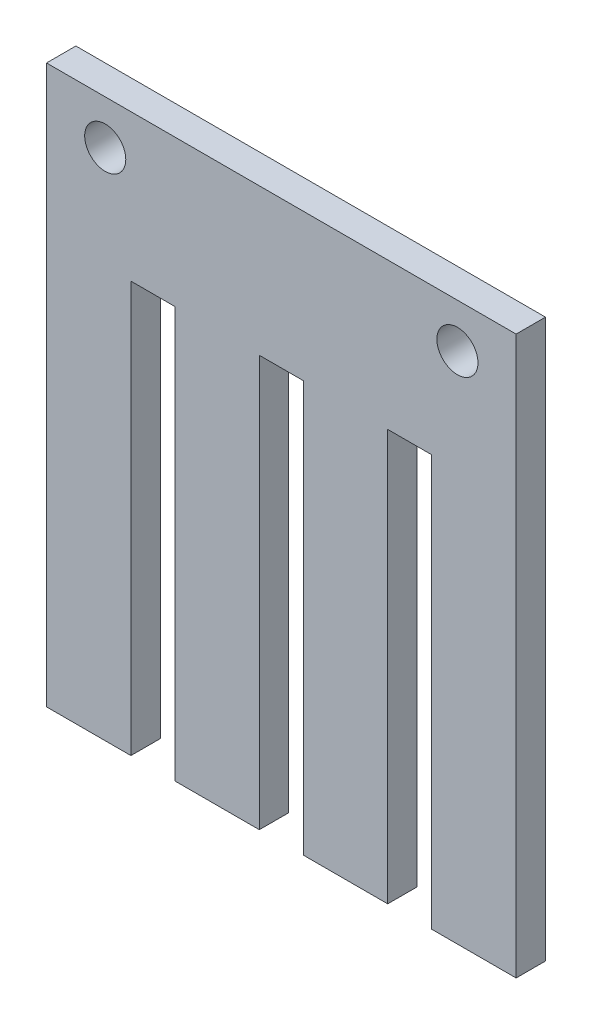
ISO-10303-21;
HEADER;
FILE_DESCRIPTION(('STEP AP214'),'2;1');
FILE_NAME('part.step','',(''),(''),'','','');
FILE_SCHEMA(('AUTOMOTIVE_DESIGN { 1 0 10303 214 1 1 1 1 }'));
ENDSEC;
DATA;
#1=APPLICATION_CONTEXT('core data for automotive mechanical design processes');
#2=APPLICATION_PROTOCOL_DEFINITION('international standard','automotive_design',2000,#1);
#3=PRODUCT_CONTEXT('',#1,'mechanical');
#4=PRODUCT('Part','Part','',(#3));
#5=PRODUCT_RELATED_PRODUCT_CATEGORY('part','',(#4));
#6=PRODUCT_DEFINITION_FORMATION('','',#4);
#7=PRODUCT_DEFINITION_CONTEXT('part definition',#1,'design');
#8=PRODUCT_DEFINITION('design','',#6,#7);
#9=PRODUCT_DEFINITION_SHAPE('','',#8);
#10=(LENGTH_UNIT() NAMED_UNIT(*) SI_UNIT(.MILLI.,.METRE.));
#11=(NAMED_UNIT(*) PLANE_ANGLE_UNIT() SI_UNIT($,.RADIAN.));
#12=(NAMED_UNIT(*) SI_UNIT($,.STERADIAN.) SOLID_ANGLE_UNIT());
#13=UNCERTAINTY_MEASURE_WITH_UNIT(LENGTH_MEASURE(1.E-05),#10,'distance_accuracy_value','');
#14=(GEOMETRIC_REPRESENTATION_CONTEXT(3) GLOBAL_UNCERTAINTY_ASSIGNED_CONTEXT((#13)) GLOBAL_UNIT_ASSIGNED_CONTEXT((#10,
#11,#12)) REPRESENTATION_CONTEXT('',''));
#15=CARTESIAN_POINT('',(0.,0.,0.));
#16=DIRECTION('',(0.,0.,1.));
#17=DIRECTION('',(1.,0.,0.));
#18=AXIS2_PLACEMENT_3D('',#15,#16,#17);
#19=CARTESIAN_POINT('',(-40.,0.,-5.));
#20=DIRECTION('',(-1.,0.,0.));
#21=DIRECTION('',(0.,-1.,0.));
#22=AXIS2_PLACEMENT_3D('',#19,#20,#21);
#23=PLANE('',#22);
#24=DIRECTION('',(0.,-1.,0.));
#25=VECTOR('',#24,1.);
#26=CARTESIAN_POINT('',(-40.,0.,0.));
#27=LINE('',#26,#25);
#28=CARTESIAN_POINT('',(-40.,0.,0.));
#29=VERTEX_POINT('',#28);
#30=CARTESIAN_POINT('',(-40.,-95.,0.));
#31=VERTEX_POINT('',#30);
#32=EDGE_CURVE('E181',#29,#31,#27,.T.);
#33=ORIENTED_EDGE('',*,*,#32,.F.);
#34=DIRECTION('',(0.,0.,1.));
#35=VECTOR('',#34,1.);
#36=CARTESIAN_POINT('',(-40.,0.,-5.));
#37=LINE('',#36,#35);
#38=CARTESIAN_POINT('',(-40.,0.,-5.));
#39=VERTEX_POINT('',#38);
#40=EDGE_CURVE('E11',#39,#29,#37,.T.);
#41=ORIENTED_EDGE('',*,*,#40,.F.);
#42=DIRECTION('',(0.,-1.,0.));
#43=VECTOR('',#42,1.);
#44=CARTESIAN_POINT('',(-40.,0.,-5.));
#45=LINE('',#44,#43);
#46=CARTESIAN_POINT('',(-40.,-95.,-5.));
#47=VERTEX_POINT('',#46);
#48=EDGE_CURVE('E226',#39,#47,#45,.T.);
#49=ORIENTED_EDGE('',*,*,#48,.T.);
#50=DIRECTION('',(0.,0.,1.));
#51=VECTOR('',#50,1.);
#52=CARTESIAN_POINT('',(-40.,-95.,-5.));
#53=LINE('',#52,#51);
#54=EDGE_CURVE('E39',#47,#31,#53,.T.);
#55=ORIENTED_EDGE('',*,*,#54,.T.);
#56=EDGE_LOOP('',(#33,#41,#49,#55));
#57=FACE_BOUND('',#56,.T.);
#58=ADVANCED_FACE('F36',(#57),#23,.T.);
#59=CARTESIAN_POINT('',(40.,0.,-5.));
#60=DIRECTION('',(0.,1.,0.));
#61=DIRECTION('',(-1.,0.,0.));
#62=AXIS2_PLACEMENT_3D('',#59,#60,#61);
#63=PLANE('',#62);
#64=DIRECTION('',(-1.,0.,0.));
#65=VECTOR('',#64,1.);
#66=CARTESIAN_POINT('',(40.,0.,0.));
#67=LINE('',#66,#65);
#68=CARTESIAN_POINT('',(40.,0.,0.));
#69=VERTEX_POINT('',#68);
#70=EDGE_CURVE('E224',#69,#29,#67,.T.);
#71=ORIENTED_EDGE('',*,*,#70,.F.);
#72=DIRECTION('',(0.,0.,1.));
#73=VECTOR('',#72,1.);
#74=CARTESIAN_POINT('',(40.,0.,-5.));
#75=LINE('',#74,#73);
#76=CARTESIAN_POINT('',(40.,0.,-5.));
#77=VERTEX_POINT('',#76);
#78=EDGE_CURVE('E45',#77,#69,#75,.T.);
#79=ORIENTED_EDGE('',*,*,#78,.F.);
#80=DIRECTION('',(-1.,0.,0.));
#81=VECTOR('',#80,1.);
#82=CARTESIAN_POINT('',(40.,0.,-5.));
#83=LINE('',#82,#81);
#84=EDGE_CURVE('E171',#77,#39,#83,.T.);
#85=ORIENTED_EDGE('',*,*,#84,.T.);
#86=ORIENTED_EDGE('',*,*,#40,.T.);
#87=EDGE_LOOP('',(#71,#79,#85,#86));
#88=FACE_BOUND('',#87,.T.);
#89=ADVANCED_FACE('F254',(#88),#63,.T.);
#90=CARTESIAN_POINT('',(40.,-95.,-5.));
#91=DIRECTION('',(1.,0.,0.));
#92=DIRECTION('',(0.,1.,0.));
#93=AXIS2_PLACEMENT_3D('',#90,#91,#92);
#94=PLANE('',#93);
#95=DIRECTION('',(0.,1.,0.));
#96=VECTOR('',#95,1.);
#97=CARTESIAN_POINT('',(40.,-95.,0.));
#98=LINE('',#97,#96);
#99=CARTESIAN_POINT('',(40.,-95.,0.));
#100=VERTEX_POINT('',#99);
#101=EDGE_CURVE('E158',#100,#69,#98,.T.);
#102=ORIENTED_EDGE('',*,*,#101,.F.);
#103=DIRECTION('',(0.,0.,1.));
#104=VECTOR('',#103,1.);
#105=CARTESIAN_POINT('',(40.,-95.,-5.));
#106=LINE('',#105,#104);
#107=CARTESIAN_POINT('',(40.,-95.,-5.));
#108=VERTEX_POINT('',#107);
#109=EDGE_CURVE('E153',#108,#100,#106,.T.);
#110=ORIENTED_EDGE('',*,*,#109,.F.);
#111=DIRECTION('',(0.,1.,0.));
#112=VECTOR('',#111,1.);
#113=CARTESIAN_POINT('',(40.,-95.,-5.));
#114=LINE('',#113,#112);
#115=EDGE_CURVE('E156',#108,#77,#114,.T.);
#116=ORIENTED_EDGE('',*,*,#115,.T.);
#117=ORIENTED_EDGE('',*,*,#78,.T.);
#118=EDGE_LOOP('',(#102,#110,#116,#117));
#119=FACE_BOUND('',#118,.T.);
#120=ADVANCED_FACE('F155',(#119),#94,.T.);
#121=CARTESIAN_POINT('',(25.625,-95.,-5.));
#122=DIRECTION('',(0.,-1.,0.));
#123=DIRECTION('',(1.,0.,0.));
#124=AXIS2_PLACEMENT_3D('',#121,#122,#123);
#125=PLANE('',#124);
#126=DIRECTION('',(1.,0.,0.));
#127=VECTOR('',#126,1.);
#128=CARTESIAN_POINT('',(25.625,-95.,0.));
#129=LINE('',#128,#127);
#130=CARTESIAN_POINT('',(25.625,-95.,0.));
#131=VERTEX_POINT('',#130);
#132=EDGE_CURVE('E221',#131,#100,#129,.T.);
#133=ORIENTED_EDGE('',*,*,#132,.F.);
#134=DIRECTION('',(0.,0.,1.));
#135=VECTOR('',#134,1.);
#136=CARTESIAN_POINT('',(25.625,-95.,-5.));
#137=LINE('',#136,#135);
#138=CARTESIAN_POINT('',(25.625,-95.,-5.));
#139=VERTEX_POINT('',#138);
#140=EDGE_CURVE('E163',#139,#131,#137,.T.);
#141=ORIENTED_EDGE('',*,*,#140,.F.);
#142=DIRECTION('',(1.,0.,0.));
#143=VECTOR('',#142,1.);
#144=CARTESIAN_POINT('',(25.625,-95.,-5.));
#145=LINE('',#144,#143);
#146=EDGE_CURVE('E169',#139,#108,#145,.T.);
#147=ORIENTED_EDGE('',*,*,#146,.T.);
#148=ORIENTED_EDGE('',*,*,#109,.T.);
#149=EDGE_LOOP('',(#133,#141,#147,#148));
#150=FACE_BOUND('',#149,.T.);
#151=ADVANCED_FACE('F173',(#150),#125,.T.);
#152=CARTESIAN_POINT('',(25.625,-25.,-5.));
#153=DIRECTION('',(-1.,0.,0.));
#154=DIRECTION('',(0.,-1.,0.));
#155=AXIS2_PLACEMENT_3D('',#152,#153,#154);
#156=PLANE('',#155);
#157=DIRECTION('',(0.,-1.,0.));
#158=VECTOR('',#157,1.);
#159=CARTESIAN_POINT('',(25.625,-25.,0.));
#160=LINE('',#159,#158);
#161=CARTESIAN_POINT('',(25.625,-25.,0.));
#162=VERTEX_POINT('',#161);
#163=EDGE_CURVE('E218',#162,#131,#160,.T.);
#164=ORIENTED_EDGE('',*,*,#163,.F.);
#165=DIRECTION('',(0.,0.,1.));
#166=VECTOR('',#165,1.);
#167=CARTESIAN_POINT('',(25.625,-25.,-5.));
#168=LINE('',#167,#166);
#169=CARTESIAN_POINT('',(25.625,-25.,-5.));
#170=VERTEX_POINT('',#169);
#171=EDGE_CURVE('E230',#170,#162,#168,.T.);
#172=ORIENTED_EDGE('',*,*,#171,.F.);
#173=DIRECTION('',(0.,-1.,0.));
#174=VECTOR('',#173,1.);
#175=CARTESIAN_POINT('',(25.625,-25.,-5.));
#176=LINE('',#175,#174);
#177=EDGE_CURVE('E174',#170,#139,#176,.T.);
#178=ORIENTED_EDGE('',*,*,#177,.T.);
#179=ORIENTED_EDGE('',*,*,#140,.T.);
#180=EDGE_LOOP('',(#164,#172,#178,#179));
#181=FACE_BOUND('',#180,.T.);
#182=ADVANCED_FACE('F267',(#181),#156,.T.);
#183=CARTESIAN_POINT('',(18.125,-25.,-5.));
#184=DIRECTION('',(0.,-1.,0.));
#185=DIRECTION('',(0.,0.,-1.));
#186=AXIS2_PLACEMENT_3D('',#183,#184,#185);
#187=PLANE('',#186);
#188=DIRECTION('',(1.,0.,0.));
#189=VECTOR('',#188,1.);
#190=CARTESIAN_POINT('',(18.125,-25.,0.));
#191=LINE('',#190,#189);
#192=CARTESIAN_POINT('',(18.125,-25.,0.));
#193=VERTEX_POINT('',#192);
#194=EDGE_CURVE('E215',#193,#162,#191,.T.);
#195=ORIENTED_EDGE('',*,*,#194,.F.);
#196=DIRECTION('',(0.,0.,1.));
#197=VECTOR('',#196,1.);
#198=CARTESIAN_POINT('',(18.125,-25.,-5.));
#199=LINE('',#198,#197);
#200=CARTESIAN_POINT('',(18.125,-25.,-5.));
#201=VERTEX_POINT('',#200);
#202=EDGE_CURVE('E232',#201,#193,#199,.T.);
#203=ORIENTED_EDGE('',*,*,#202,.F.);
#204=DIRECTION('',(1.,0.,0.));
#205=VECTOR('',#204,1.);
#206=CARTESIAN_POINT('',(18.125,-25.,-5.));
#207=LINE('',#206,#205);
#208=EDGE_CURVE('E176',#201,#170,#207,.T.);
#209=ORIENTED_EDGE('',*,*,#208,.T.);
#210=ORIENTED_EDGE('',*,*,#171,.T.);
#211=EDGE_LOOP('',(#195,#203,#209,#210));
#212=FACE_BOUND('',#211,.T.);
#213=ADVANCED_FACE('F270',(#212),#187,.T.);
#214=CARTESIAN_POINT('',(18.125,-95.,-5.));
#215=DIRECTION('',(1.,0.,0.));
#216=DIRECTION('',(0.,1.,0.));
#217=AXIS2_PLACEMENT_3D('',#214,#215,#216);
#218=PLANE('',#217);
#219=DIRECTION('',(0.,1.,0.));
#220=VECTOR('',#219,1.);
#221=CARTESIAN_POINT('',(18.125,-95.,0.));
#222=LINE('',#221,#220);
#223=CARTESIAN_POINT('',(18.125,-95.,0.));
#224=VERTEX_POINT('',#223);
#225=EDGE_CURVE('E212',#224,#193,#222,.T.);
#226=ORIENTED_EDGE('',*,*,#225,.F.);
#227=DIRECTION('',(0.,0.,1.));
#228=VECTOR('',#227,1.);
#229=CARTESIAN_POINT('',(18.125,-95.,-5.));
#230=LINE('',#229,#228);
#231=CARTESIAN_POINT('',(18.125,-95.,-5.));
#232=VERTEX_POINT('',#231);
#233=EDGE_CURVE('E234',#232,#224,#230,.T.);
#234=ORIENTED_EDGE('',*,*,#233,.F.);
#235=DIRECTION('',(0.,1.,0.));
#236=VECTOR('',#235,1.);
#237=CARTESIAN_POINT('',(18.125,-95.,-5.));
#238=LINE('',#237,#236);
#239=EDGE_CURVE('E372',#232,#201,#238,.T.);
#240=ORIENTED_EDGE('',*,*,#239,.T.);
#241=ORIENTED_EDGE('',*,*,#202,.T.);
#242=EDGE_LOOP('',(#226,#234,#240,#241));
#243=FACE_BOUND('',#242,.T.);
#244=ADVANCED_FACE('F274',(#243),#218,.T.);
#245=CARTESIAN_POINT('',(3.75000000000001,-95.,-5.));
#246=DIRECTION('',(0.,-1.,0.));
#247=DIRECTION('',(0.,0.,-1.));
#248=AXIS2_PLACEMENT_3D('',#245,#246,#247);
#249=PLANE('',#248);
#250=DIRECTION('',(1.,0.,0.));
#251=VECTOR('',#250,1.);
#252=CARTESIAN_POINT('',(3.75000000000001,-95.,0.));
#253=LINE('',#252,#251);
#254=CARTESIAN_POINT('',(3.75000000000001,-95.,0.));
#255=VERTEX_POINT('',#254);
#256=EDGE_CURVE('E209',#255,#224,#253,.T.);
#257=ORIENTED_EDGE('',*,*,#256,.F.);
#258=DIRECTION('',(0.,0.,1.));
#259=VECTOR('',#258,1.);
#260=CARTESIAN_POINT('',(3.75000000000001,-95.,-5.));
#261=LINE('',#260,#259);
#262=CARTESIAN_POINT('',(3.75000000000001,-95.,-5.));
#263=VERTEX_POINT('',#262);
#264=EDGE_CURVE('E236',#263,#255,#261,.T.);
#265=ORIENTED_EDGE('',*,*,#264,.F.);
#266=DIRECTION('',(1.,0.,0.));
#267=VECTOR('',#266,1.);
#268=CARTESIAN_POINT('',(3.75000000000001,-95.,-5.));
#269=LINE('',#268,#267);
#270=EDGE_CURVE('E369',#263,#232,#269,.T.);
#271=ORIENTED_EDGE('',*,*,#270,.T.);
#272=ORIENTED_EDGE('',*,*,#233,.T.);
#273=EDGE_LOOP('',(#257,#265,#271,#272));
#274=FACE_BOUND('',#273,.T.);
#275=ADVANCED_FACE('F278',(#274),#249,.T.);
#276=CARTESIAN_POINT('',(3.74999999999998,-25.,-5.));
#277=DIRECTION('',(-1.,0.,0.));
#278=DIRECTION('',(0.,-1.,0.));
#279=AXIS2_PLACEMENT_3D('',#276,#277,#278);
#280=PLANE('',#279);
#281=DIRECTION('',(0.,-1.,0.));
#282=VECTOR('',#281,1.);
#283=CARTESIAN_POINT('',(3.74999999999998,-25.,0.));
#284=LINE('',#283,#282);
#285=CARTESIAN_POINT('',(3.74999999999998,-25.,0.));
#286=VERTEX_POINT('',#285);
#287=EDGE_CURVE('E206',#286,#255,#284,.T.);
#288=ORIENTED_EDGE('',*,*,#287,.F.);
#289=DIRECTION('',(0.,0.,1.));
#290=VECTOR('',#289,1.);
#291=CARTESIAN_POINT('',(3.74999999999998,-25.,-5.));
#292=LINE('',#291,#290);
#293=CARTESIAN_POINT('',(3.74999999999998,-25.,-5.));
#294=VERTEX_POINT('',#293);
#295=EDGE_CURVE('E238',#294,#286,#292,.T.);
#296=ORIENTED_EDGE('',*,*,#295,.F.);
#297=DIRECTION('',(0.,-1.,0.));
#298=VECTOR('',#297,1.);
#299=CARTESIAN_POINT('',(3.74999999999998,-25.,-5.));
#300=LINE('',#299,#298);
#301=EDGE_CURVE('E366',#294,#263,#300,.T.);
#302=ORIENTED_EDGE('',*,*,#301,.T.);
#303=ORIENTED_EDGE('',*,*,#264,.T.);
#304=EDGE_LOOP('',(#288,#296,#302,#303));
#305=FACE_BOUND('',#304,.T.);
#306=ADVANCED_FACE('F282',(#305),#280,.T.);
#307=CARTESIAN_POINT('',(-3.74999999999999,-25.,-5.));
#308=DIRECTION('',(0.,-1.,0.));
#309=DIRECTION('',(0.,0.,-1.));
#310=AXIS2_PLACEMENT_3D('',#307,#308,#309);
#311=PLANE('',#310);
#312=DIRECTION('',(1.,0.,0.));
#313=VECTOR('',#312,1.);
#314=CARTESIAN_POINT('',(-3.74999999999999,-25.,0.));
#315=LINE('',#314,#313);
#316=CARTESIAN_POINT('',(-3.74999999999999,-25.,0.));
#317=VERTEX_POINT('',#316);
#318=EDGE_CURVE('E203',#317,#286,#315,.T.);
#319=ORIENTED_EDGE('',*,*,#318,.F.);
#320=DIRECTION('',(0.,0.,1.));
#321=VECTOR('',#320,1.);
#322=CARTESIAN_POINT('',(-3.74999999999999,-25.,-5.));
#323=LINE('',#322,#321);
#324=CARTESIAN_POINT('',(-3.74999999999999,-25.,-5.));
#325=VERTEX_POINT('',#324);
#326=EDGE_CURVE('E240',#325,#317,#323,.T.);
#327=ORIENTED_EDGE('',*,*,#326,.F.);
#328=DIRECTION('',(1.,0.,0.));
#329=VECTOR('',#328,1.);
#330=CARTESIAN_POINT('',(-3.74999999999999,-25.,-5.));
#331=LINE('',#330,#329);
#332=EDGE_CURVE('E363',#325,#294,#331,.T.);
#333=ORIENTED_EDGE('',*,*,#332,.T.);
#334=ORIENTED_EDGE('',*,*,#295,.T.);
#335=EDGE_LOOP('',(#319,#327,#333,#334));
#336=FACE_BOUND('',#335,.T.);
#337=ADVANCED_FACE('F286',(#336),#311,.T.);
#338=CARTESIAN_POINT('',(-3.74999999999999,-95.,-5.));
#339=DIRECTION('',(1.,0.,0.));
#340=DIRECTION('',(0.,1.,0.));
#341=AXIS2_PLACEMENT_3D('',#338,#339,#340);
#342=PLANE('',#341);
#343=DIRECTION('',(0.,1.,0.));
#344=VECTOR('',#343,1.);
#345=CARTESIAN_POINT('',(-3.74999999999999,-95.,0.));
#346=LINE('',#345,#344);
#347=CARTESIAN_POINT('',(-3.74999999999999,-95.,0.));
#348=VERTEX_POINT('',#347);
#349=EDGE_CURVE('E200',#348,#317,#346,.T.);
#350=ORIENTED_EDGE('',*,*,#349,.F.);
#351=DIRECTION('',(0.,0.,1.));
#352=VECTOR('',#351,1.);
#353=CARTESIAN_POINT('',(-3.74999999999999,-95.,-5.));
#354=LINE('',#353,#352);
#355=CARTESIAN_POINT('',(-3.74999999999999,-95.,-5.));
#356=VERTEX_POINT('',#355);
#357=EDGE_CURVE('E242',#356,#348,#354,.T.);
#358=ORIENTED_EDGE('',*,*,#357,.F.);
#359=DIRECTION('',(0.,1.,0.));
#360=VECTOR('',#359,1.);
#361=CARTESIAN_POINT('',(-3.74999999999999,-95.,-5.));
#362=LINE('',#361,#360);
#363=EDGE_CURVE('E360',#356,#325,#362,.T.);
#364=ORIENTED_EDGE('',*,*,#363,.T.);
#365=ORIENTED_EDGE('',*,*,#326,.T.);
#366=EDGE_LOOP('',(#350,#358,#364,#365));
#367=FACE_BOUND('',#366,.T.);
#368=ADVANCED_FACE('F290',(#367),#342,.T.);
#369=CARTESIAN_POINT('',(-18.125,-95.,-5.));
#370=DIRECTION('',(0.,-1.,0.));
#371=DIRECTION('',(0.,0.,-1.));
#372=AXIS2_PLACEMENT_3D('',#369,#370,#371);
#373=PLANE('',#372);
#374=DIRECTION('',(1.,0.,0.));
#375=VECTOR('',#374,1.);
#376=CARTESIAN_POINT('',(-18.125,-95.,0.));
#377=LINE('',#376,#375);
#378=CARTESIAN_POINT('',(-18.125,-95.,0.));
#379=VERTEX_POINT('',#378);
#380=EDGE_CURVE('E197',#379,#348,#377,.T.);
#381=ORIENTED_EDGE('',*,*,#380,.F.);
#382=DIRECTION('',(0.,0.,1.));
#383=VECTOR('',#382,1.);
#384=CARTESIAN_POINT('',(-18.125,-95.,-5.));
#385=LINE('',#384,#383);
#386=CARTESIAN_POINT('',(-18.125,-95.,-5.));
#387=VERTEX_POINT('',#386);
#388=EDGE_CURVE('E244',#387,#379,#385,.T.);
#389=ORIENTED_EDGE('',*,*,#388,.F.);
#390=DIRECTION('',(1.,0.,0.));
#391=VECTOR('',#390,1.);
#392=CARTESIAN_POINT('',(-18.125,-95.,-5.));
#393=LINE('',#392,#391);
#394=EDGE_CURVE('E357',#387,#356,#393,.T.);
#395=ORIENTED_EDGE('',*,*,#394,.T.);
#396=ORIENTED_EDGE('',*,*,#357,.T.);
#397=EDGE_LOOP('',(#381,#389,#395,#396));
#398=FACE_BOUND('',#397,.T.);
#399=ADVANCED_FACE('F294',(#398),#373,.T.);
#400=CARTESIAN_POINT('',(-18.125,-25.,-5.));
#401=DIRECTION('',(-1.,0.,0.));
#402=DIRECTION('',(0.,-1.,0.));
#403=AXIS2_PLACEMENT_3D('',#400,#401,#402);
#404=PLANE('',#403);
#405=DIRECTION('',(0.,-1.,0.));
#406=VECTOR('',#405,1.);
#407=CARTESIAN_POINT('',(-18.125,-25.,0.));
#408=LINE('',#407,#406);
#409=CARTESIAN_POINT('',(-18.125,-25.,0.));
#410=VERTEX_POINT('',#409);
#411=EDGE_CURVE('E194',#410,#379,#408,.T.);
#412=ORIENTED_EDGE('',*,*,#411,.F.);
#413=DIRECTION('',(0.,0.,1.));
#414=VECTOR('',#413,1.);
#415=CARTESIAN_POINT('',(-18.125,-25.,-5.));
#416=LINE('',#415,#414);
#417=CARTESIAN_POINT('',(-18.125,-25.,-5.));
#418=VERTEX_POINT('',#417);
#419=EDGE_CURVE('E246',#418,#410,#416,.T.);
#420=ORIENTED_EDGE('',*,*,#419,.F.);
#421=DIRECTION('',(0.,-1.,0.));
#422=VECTOR('',#421,1.);
#423=CARTESIAN_POINT('',(-18.125,-25.,-5.));
#424=LINE('',#423,#422);
#425=EDGE_CURVE('E354',#418,#387,#424,.T.);
#426=ORIENTED_EDGE('',*,*,#425,.T.);
#427=ORIENTED_EDGE('',*,*,#388,.T.);
#428=EDGE_LOOP('',(#412,#420,#426,#427));
#429=FACE_BOUND('',#428,.T.);
#430=ADVANCED_FACE('F298',(#429),#404,.T.);
#431=CARTESIAN_POINT('',(-25.625,-25.,-5.));
#432=DIRECTION('',(0.,-1.,0.));
#433=DIRECTION('',(0.,0.,-1.));
#434=AXIS2_PLACEMENT_3D('',#431,#432,#433);
#435=PLANE('',#434);
#436=DIRECTION('',(1.,0.,0.));
#437=VECTOR('',#436,1.);
#438=CARTESIAN_POINT('',(-25.625,-25.,0.));
#439=LINE('',#438,#437);
#440=CARTESIAN_POINT('',(-25.625,-25.,0.));
#441=VERTEX_POINT('',#440);
#442=EDGE_CURVE('E191',#441,#410,#439,.T.);
#443=ORIENTED_EDGE('',*,*,#442,.F.);
#444=DIRECTION('',(0.,0.,1.));
#445=VECTOR('',#444,1.);
#446=CARTESIAN_POINT('',(-25.625,-25.,-5.));
#447=LINE('',#446,#445);
#448=CARTESIAN_POINT('',(-25.625,-25.,-5.));
#449=VERTEX_POINT('',#448);
#450=EDGE_CURVE('E248',#449,#441,#447,.T.);
#451=ORIENTED_EDGE('',*,*,#450,.F.);
#452=DIRECTION('',(1.,0.,0.));
#453=VECTOR('',#452,1.);
#454=CARTESIAN_POINT('',(-25.625,-25.,-5.));
#455=LINE('',#454,#453);
#456=EDGE_CURVE('E351',#449,#418,#455,.T.);
#457=ORIENTED_EDGE('',*,*,#456,.T.);
#458=ORIENTED_EDGE('',*,*,#419,.T.);
#459=EDGE_LOOP('',(#443,#451,#457,#458));
#460=FACE_BOUND('',#459,.T.);
#461=ADVANCED_FACE('F302',(#460),#435,.T.);
#462=CARTESIAN_POINT('',(-25.625,-95.,-5.));
#463=DIRECTION('',(1.,0.,0.));
#464=DIRECTION('',(0.,1.,0.));
#465=AXIS2_PLACEMENT_3D('',#462,#463,#464);
#466=PLANE('',#465);
#467=DIRECTION('',(0.,1.,0.));
#468=VECTOR('',#467,1.);
#469=CARTESIAN_POINT('',(-25.625,-95.,0.));
#470=LINE('',#469,#468);
#471=CARTESIAN_POINT('',(-25.625,-95.,0.));
#472=VERTEX_POINT('',#471);
#473=EDGE_CURVE('E188',#472,#441,#470,.T.);
#474=ORIENTED_EDGE('',*,*,#473,.F.);
#475=DIRECTION('',(0.,0.,1.));
#476=VECTOR('',#475,1.);
#477=CARTESIAN_POINT('',(-25.625,-95.,-5.));
#478=LINE('',#477,#476);
#479=CARTESIAN_POINT('',(-25.625,-95.,-5.));
#480=VERTEX_POINT('',#479);
#481=EDGE_CURVE('E249',#480,#472,#478,.T.);
#482=ORIENTED_EDGE('',*,*,#481,.F.);
#483=DIRECTION('',(0.,1.,0.));
#484=VECTOR('',#483,1.);
#485=CARTESIAN_POINT('',(-25.625,-95.,-5.));
#486=LINE('',#485,#484);
#487=EDGE_CURVE('E348',#480,#449,#486,.T.);
#488=ORIENTED_EDGE('',*,*,#487,.T.);
#489=ORIENTED_EDGE('',*,*,#450,.T.);
#490=EDGE_LOOP('',(#474,#482,#488,#489));
#491=FACE_BOUND('',#490,.T.);
#492=ADVANCED_FACE('F306',(#491),#466,.T.);
#493=CARTESIAN_POINT('',(-40.,-95.,-5.));
#494=DIRECTION('',(0.,-1.,0.));
#495=DIRECTION('',(1.,0.,0.));
#496=AXIS2_PLACEMENT_3D('',#493,#494,#495);
#497=PLANE('',#496);
#498=DIRECTION('',(1.,0.,0.));
#499=VECTOR('',#498,1.);
#500=CARTESIAN_POINT('',(-40.,-95.,0.));
#501=LINE('',#500,#499);
#502=EDGE_CURVE('E184',#31,#472,#501,.T.);
#503=ORIENTED_EDGE('',*,*,#502,.F.);
#504=ORIENTED_EDGE('',*,*,#54,.F.);
#505=DIRECTION('',(1.,0.,0.));
#506=VECTOR('',#505,1.);
#507=CARTESIAN_POINT('',(-40.,-95.,-5.));
#508=LINE('',#507,#506);
#509=EDGE_CURVE('E346',#47,#480,#508,.T.);
#510=ORIENTED_EDGE('',*,*,#509,.T.);
#511=ORIENTED_EDGE('',*,*,#481,.T.);
#512=EDGE_LOOP('',(#503,#504,#510,#511));
#513=FACE_BOUND('',#512,.T.);
#514=ADVANCED_FACE('F251',(#513),#497,.T.);
#515=CARTESIAN_POINT('',(0.,0.,-5.));
#516=DIRECTION('',(0.,0.,1.));
#517=DIRECTION('',(1.,0.,0.));
#518=AXIS2_PLACEMENT_3D('',#515,#516,#517);
#519=PLANE('',#518);
#520=CARTESIAN_POINT('',(-30.,-7.50000000000001,-5.));
#521=DIRECTION('',(0.,0.,1.));
#522=DIRECTION('',(1.,0.,0.));
#523=AXIS2_PLACEMENT_3D('',#520,#521,#522);
#524=CIRCLE('',#523,3.5);
#525=CARTESIAN_POINT('',(-26.5,-7.50000000000001,-5.));
#526=VERTEX_POINT('',#525);
#527=EDGE_CURVE('E185',#526,#526,#524,.T.);
#528=ORIENTED_EDGE('',*,*,#527,.T.);
#529=EDGE_LOOP('',(#528));
#530=FACE_BOUND('',#529,.T.);
#531=CARTESIAN_POINT('',(30.,-7.50000000000001,-5.));
#532=DIRECTION('',(0.,0.,1.));
#533=DIRECTION('',(1.,0.,0.));
#534=AXIS2_PLACEMENT_3D('',#531,#532,#533);
#535=CIRCLE('',#534,3.5);
#536=CARTESIAN_POINT('',(33.5,-7.50000000000001,-5.));
#537=VERTEX_POINT('',#536);
#538=EDGE_CURVE('E336',#537,#537,#535,.T.);
#539=ORIENTED_EDGE('',*,*,#538,.T.);
#540=EDGE_LOOP('',(#539));
#541=FACE_BOUND('',#540,.T.);
#542=ORIENTED_EDGE('',*,*,#48,.F.);
#543=ORIENTED_EDGE('',*,*,#84,.F.);
#544=ORIENTED_EDGE('',*,*,#115,.F.);
#545=ORIENTED_EDGE('',*,*,#146,.F.);
#546=ORIENTED_EDGE('',*,*,#177,.F.);
#547=ORIENTED_EDGE('',*,*,#208,.F.);
#548=ORIENTED_EDGE('',*,*,#239,.F.);
#549=ORIENTED_EDGE('',*,*,#270,.F.);
#550=ORIENTED_EDGE('',*,*,#301,.F.);
#551=ORIENTED_EDGE('',*,*,#332,.F.);
#552=ORIENTED_EDGE('',*,*,#363,.F.);
#553=ORIENTED_EDGE('',*,*,#394,.F.);
#554=ORIENTED_EDGE('',*,*,#425,.F.);
#555=ORIENTED_EDGE('',*,*,#456,.F.);
#556=ORIENTED_EDGE('',*,*,#487,.F.);
#557=ORIENTED_EDGE('',*,*,#509,.F.);
#558=EDGE_LOOP('',(#542,#543,#544,#545,#546,#547,#548,#549,#550,#551,#552,#553,#554,#555,#556,#557));
#559=FACE_BOUND('',#558,.T.);
#560=ADVANCED_FACE('F167',(#530,#541,#559),#519,.F.);
#561=CARTESIAN_POINT('',(0.,0.,0.));
#562=DIRECTION('',(0.,0.,1.));
#563=DIRECTION('',(1.,0.,0.));
#564=AXIS2_PLACEMENT_3D('',#561,#562,#563);
#565=PLANE('',#564);
#566=CARTESIAN_POINT('',(-30.,-7.50000000000001,0.));
#567=DIRECTION('',(0.,0.,1.));
#568=DIRECTION('',(1.,0.,0.));
#569=AXIS2_PLACEMENT_3D('',#566,#567,#568);
#570=CIRCLE('',#569,3.5);
#571=CARTESIAN_POINT('',(-26.5,-7.50000000000001,0.));
#572=VERTEX_POINT('',#571);
#573=EDGE_CURVE('E335',#572,#572,#570,.T.);
#574=ORIENTED_EDGE('',*,*,#573,.F.);
#575=EDGE_LOOP('',(#574));
#576=FACE_BOUND('',#575,.T.);
#577=CARTESIAN_POINT('',(30.,-7.50000000000001,0.));
#578=DIRECTION('',(0.,0.,1.));
#579=DIRECTION('',(1.,0.,0.));
#580=AXIS2_PLACEMENT_3D('',#577,#578,#579);
#581=CIRCLE('',#580,3.5);
#582=CARTESIAN_POINT('',(33.5,-7.50000000000001,0.));
#583=VERTEX_POINT('',#582);
#584=EDGE_CURVE('E340',#583,#583,#581,.T.);
#585=ORIENTED_EDGE('',*,*,#584,.F.);
#586=EDGE_LOOP('',(#585));
#587=FACE_BOUND('',#586,.T.);
#588=ORIENTED_EDGE('',*,*,#32,.T.);
#589=ORIENTED_EDGE('',*,*,#502,.T.);
#590=ORIENTED_EDGE('',*,*,#473,.T.);
#591=ORIENTED_EDGE('',*,*,#442,.T.);
#592=ORIENTED_EDGE('',*,*,#411,.T.);
#593=ORIENTED_EDGE('',*,*,#380,.T.);
#594=ORIENTED_EDGE('',*,*,#349,.T.);
#595=ORIENTED_EDGE('',*,*,#318,.T.);
#596=ORIENTED_EDGE('',*,*,#287,.T.);
#597=ORIENTED_EDGE('',*,*,#256,.T.);
#598=ORIENTED_EDGE('',*,*,#225,.T.);
#599=ORIENTED_EDGE('',*,*,#194,.T.);
#600=ORIENTED_EDGE('',*,*,#163,.T.);
#601=ORIENTED_EDGE('',*,*,#132,.T.);
#602=ORIENTED_EDGE('',*,*,#101,.T.);
#603=ORIENTED_EDGE('',*,*,#70,.T.);
#604=EDGE_LOOP('',(#588,#589,#590,#591,#592,#593,#594,#595,#596,#597,#598,#599,#600,#601,#602,#603));
#605=FACE_BOUND('',#604,.T.);
#606=ADVANCED_FACE('F253',(#576,#587,#605),#565,.T.);
#607=CARTESIAN_POINT('',(30.,-7.50000000000001,-5.));
#608=DIRECTION('',(0.,0.,1.));
#609=DIRECTION('',(1.,0.,0.));
#610=AXIS2_PLACEMENT_3D('',#607,#608,#609);
#611=CYLINDRICAL_SURFACE('',#610,3.5);
#612=ORIENTED_EDGE('',*,*,#538,.F.);
#613=EDGE_LOOP('',(#612));
#614=FACE_BOUND('',#613,.T.);
#615=ORIENTED_EDGE('',*,*,#584,.T.);
#616=EDGE_LOOP('',(#615));
#617=FACE_BOUND('',#616,.T.);
#618=ADVANCED_FACE('F318',(#614,#617),#611,.F.);
#619=CARTESIAN_POINT('',(-30.,-7.50000000000001,-5.));
#620=DIRECTION('',(0.,0.,1.));
#621=DIRECTION('',(1.,0.,0.));
#622=AXIS2_PLACEMENT_3D('',#619,#620,#621);
#623=CYLINDRICAL_SURFACE('',#622,3.5);
#624=ORIENTED_EDGE('',*,*,#527,.F.);
#625=EDGE_LOOP('',(#624));
#626=FACE_BOUND('',#625,.T.);
#627=ORIENTED_EDGE('',*,*,#573,.T.);
#628=EDGE_LOOP('',(#627));
#629=FACE_BOUND('',#628,.T.);
#630=ADVANCED_FACE('F325',(#626,#629),#623,.F.);
#631=CLOSED_SHELL('',(#58,#89,#120,#151,#182,#213,#244,#275,#306,#337,#368,#399,#430,#461,#492,
#514,#560,#606,#618,#630));
#632=MANIFOLD_SOLID_BREP('B2',#631);
#633=ADVANCED_BREP_SHAPE_REPRESENTATION('',(#18,#632),#14);
#634=SHAPE_DEFINITION_REPRESENTATION(#9,#633);
ENDSEC;
END-ISO-10303-21;
